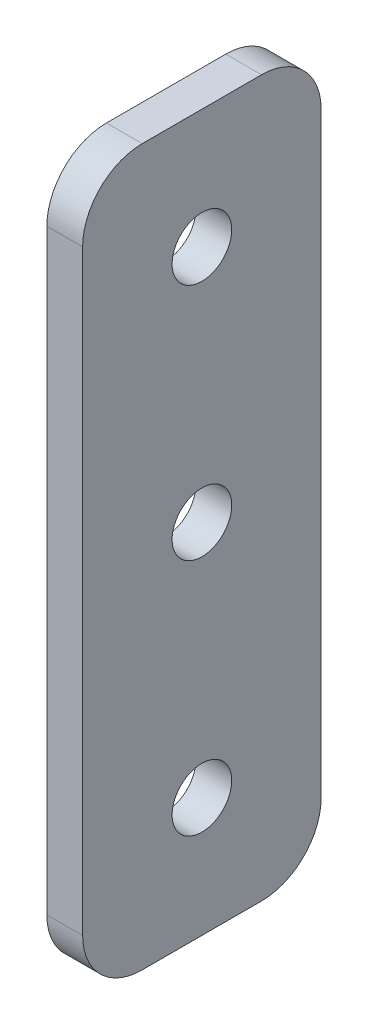
ISO-10303-21;
HEADER;
FILE_DESCRIPTION(('STEP AP214'),'2;1');
FILE_NAME('part.step','',(''),(''),'','','');
FILE_SCHEMA(('AUTOMOTIVE_DESIGN { 1 0 10303 214 1 1 1 1 }'));
ENDSEC;
DATA;
#1=APPLICATION_CONTEXT('core data for automotive mechanical design processes');
#2=APPLICATION_PROTOCOL_DEFINITION('international standard','automotive_design',2000,#1);
#3=PRODUCT_CONTEXT('',#1,'mechanical');
#4=PRODUCT('Part','Part','',(#3));
#5=PRODUCT_RELATED_PRODUCT_CATEGORY('part','',(#4));
#6=PRODUCT_DEFINITION_FORMATION('','',#4);
#7=PRODUCT_DEFINITION_CONTEXT('part definition',#1,'design');
#8=PRODUCT_DEFINITION('design','',#6,#7);
#9=PRODUCT_DEFINITION_SHAPE('','',#8);
#10=(LENGTH_UNIT() NAMED_UNIT(*) SI_UNIT(.MILLI.,.METRE.));
#11=(NAMED_UNIT(*) PLANE_ANGLE_UNIT() SI_UNIT($,.RADIAN.));
#12=(NAMED_UNIT(*) SI_UNIT($,.STERADIAN.) SOLID_ANGLE_UNIT());
#13=UNCERTAINTY_MEASURE_WITH_UNIT(LENGTH_MEASURE(1.E-05),#10,'distance_accuracy_value','');
#14=(GEOMETRIC_REPRESENTATION_CONTEXT(3) GLOBAL_UNCERTAINTY_ASSIGNED_CONTEXT((#13)) GLOBAL_UNIT_ASSIGNED_CONTEXT((#10,
#11,#12)) REPRESENTATION_CONTEXT('',''));
#15=CARTESIAN_POINT('',(0.,0.,0.));
#16=DIRECTION('',(0.,0.,1.));
#17=DIRECTION('',(1.,0.,0.));
#18=AXIS2_PLACEMENT_3D('',#15,#16,#17);
#19=CARTESIAN_POINT('',(3.,0.,0.));
#20=DIRECTION('',(1.,0.,0.));
#21=DIRECTION('',(0.,0.,-1.));
#22=AXIS2_PLACEMENT_3D('',#19,#20,#21);
#23=PLANE('',#22);
#24=CARTESIAN_POINT('',(3.,30.,0.));
#25=DIRECTION('',(1.,0.,0.));
#26=DIRECTION('',(0.,0.,-1.));
#27=AXIS2_PLACEMENT_3D('',#24,#25,#26);
#28=CIRCLE('',#27,2.5);
#29=CARTESIAN_POINT('',(3.,30.,-2.5));
#30=VERTEX_POINT('',#29);
#31=EDGE_CURVE('E183',#30,#30,#28,.T.);
#32=ORIENTED_EDGE('',*,*,#31,.F.);
#33=EDGE_LOOP('',(#32));
#34=FACE_BOUND('',#33,.T.);
#35=DIRECTION('',(0.,0.,-1.));
#36=VECTOR('',#35,1.);
#37=CARTESIAN_POINT('',(3.,0.,10.));
#38=LINE('',#37,#36);
#39=CARTESIAN_POINT('',(3.,0.,5.));
#40=VERTEX_POINT('',#39);
#41=CARTESIAN_POINT('',(3.,0.,-5.));
#42=VERTEX_POINT('',#41);
#43=EDGE_CURVE('E168',#40,#42,#38,.T.);
#44=ORIENTED_EDGE('',*,*,#43,.T.);
#45=CARTESIAN_POINT('',(3.,5.,-5.));
#46=DIRECTION('',(1.,0.,0.));
#47=DIRECTION('',(0.,0.,-1.));
#48=AXIS2_PLACEMENT_3D('',#45,#46,#47);
#49=CIRCLE('',#48,5.);
#50=CARTESIAN_POINT('',(3.,5.,-10.));
#51=VERTEX_POINT('',#50);
#52=EDGE_CURVE('E148',#42,#51,#49,.T.);
#53=ORIENTED_EDGE('',*,*,#52,.T.);
#54=DIRECTION('',(0.,1.,0.));
#55=VECTOR('',#54,1.);
#56=CARTESIAN_POINT('',(3.,60.,-9.99999999999999));
#57=LINE('',#56,#55);
#58=CARTESIAN_POINT('',(3.,55.,-9.99999999999999));
#59=VERTEX_POINT('',#58);
#60=EDGE_CURVE('E118',#51,#59,#57,.T.);
#61=ORIENTED_EDGE('',*,*,#60,.T.);
#62=CARTESIAN_POINT('',(3.,55.,-4.99999999999999));
#63=DIRECTION('',(1.,0.,0.));
#64=DIRECTION('',(0.,0.,-1.));
#65=AXIS2_PLACEMENT_3D('',#62,#63,#64);
#66=CIRCLE('',#65,5.);
#67=CARTESIAN_POINT('',(3.,60.,-4.99999999999999));
#68=VERTEX_POINT('',#67);
#69=EDGE_CURVE('E54',#59,#68,#66,.T.);
#70=ORIENTED_EDGE('',*,*,#69,.T.);
#71=DIRECTION('',(0.,0.,1.));
#72=VECTOR('',#71,1.);
#73=CARTESIAN_POINT('',(3.,60.,10.));
#74=LINE('',#73,#72);
#75=CARTESIAN_POINT('',(3.,60.,5.00000000000001));
#76=VERTEX_POINT('',#75);
#77=EDGE_CURVE('E135',#68,#76,#74,.T.);
#78=ORIENTED_EDGE('',*,*,#77,.T.);
#79=CARTESIAN_POINT('',(3.,55.,5.00000000000001));
#80=DIRECTION('',(1.,0.,0.));
#81=DIRECTION('',(0.,0.,-1.));
#82=AXIS2_PLACEMENT_3D('',#79,#80,#81);
#83=CIRCLE('',#82,5.);
#84=CARTESIAN_POINT('',(3.,55.,10.));
#85=VERTEX_POINT('',#84);
#86=EDGE_CURVE('E143',#76,#85,#83,.T.);
#87=ORIENTED_EDGE('',*,*,#86,.T.);
#88=DIRECTION('',(0.,-1.,0.));
#89=VECTOR('',#88,1.);
#90=CARTESIAN_POINT('',(3.,60.,10.));
#91=LINE('',#90,#89);
#92=CARTESIAN_POINT('',(3.,5.,10.));
#93=VERTEX_POINT('',#92);
#94=EDGE_CURVE('E129',#85,#93,#91,.T.);
#95=ORIENTED_EDGE('',*,*,#94,.T.);
#96=CARTESIAN_POINT('',(3.,5.,5.));
#97=DIRECTION('',(1.,0.,0.));
#98=DIRECTION('',(0.,0.,-1.));
#99=AXIS2_PLACEMENT_3D('',#96,#97,#98);
#100=CIRCLE('',#99,5.);
#101=EDGE_CURVE('E146',#93,#40,#100,.T.);
#102=ORIENTED_EDGE('',*,*,#101,.T.);
#103=EDGE_LOOP('',(#44,#53,#61,#70,#78,#87,#95,#102));
#104=FACE_BOUND('',#103,.T.);
#105=CARTESIAN_POINT('',(3.,10.,0.));
#106=DIRECTION('',(1.,0.,0.));
#107=DIRECTION('',(0.,0.,-1.));
#108=AXIS2_PLACEMENT_3D('',#105,#106,#107);
#109=CIRCLE('',#108,2.5);
#110=CARTESIAN_POINT('',(3.,10.,-2.5));
#111=VERTEX_POINT('',#110);
#112=EDGE_CURVE('E174',#111,#111,#109,.T.);
#113=ORIENTED_EDGE('',*,*,#112,.F.);
#114=EDGE_LOOP('',(#113));
#115=FACE_BOUND('',#114,.T.);
#116=CARTESIAN_POINT('',(3.,50.,0.));
#117=DIRECTION('',(1.,0.,0.));
#118=DIRECTION('',(0.,0.,-1.));
#119=AXIS2_PLACEMENT_3D('',#116,#117,#118);
#120=CIRCLE('',#119,2.5);
#121=CARTESIAN_POINT('',(3.,50.,-2.5));
#122=VERTEX_POINT('',#121);
#123=EDGE_CURVE('E188',#122,#122,#120,.T.);
#124=ORIENTED_EDGE('',*,*,#123,.F.);
#125=EDGE_LOOP('',(#124));
#126=FACE_BOUND('',#125,.T.);
#127=ADVANCED_FACE('F33',(#34,#104,#115,#126),#23,.T.);
#128=CARTESIAN_POINT('',(0.,0.,0.));
#129=DIRECTION('',(1.,0.,0.));
#130=DIRECTION('',(0.,0.,-1.));
#131=AXIS2_PLACEMENT_3D('',#128,#129,#130);
#132=PLANE('',#131);
#133=CARTESIAN_POINT('',(0.,30.,0.));
#134=DIRECTION('',(1.,0.,0.));
#135=DIRECTION('',(0.,0.,-1.));
#136=AXIS2_PLACEMENT_3D('',#133,#134,#135);
#137=CIRCLE('',#136,2.5);
#138=CARTESIAN_POINT('',(0.,30.,-2.5));
#139=VERTEX_POINT('',#138);
#140=EDGE_CURVE('E185',#139,#139,#137,.T.);
#141=ORIENTED_EDGE('',*,*,#140,.T.);
#142=EDGE_LOOP('',(#141));
#143=FACE_BOUND('',#142,.T.);
#144=DIRECTION('',(0.,1.,0.));
#145=VECTOR('',#144,1.);
#146=CARTESIAN_POINT('',(0.,60.,-9.99999999999999));
#147=LINE('',#146,#145);
#148=CARTESIAN_POINT('',(0.,5.,-10.));
#149=VERTEX_POINT('',#148);
#150=CARTESIAN_POINT('',(0.,55.,-9.99999999999999));
#151=VERTEX_POINT('',#150);
#152=EDGE_CURVE('E116',#149,#151,#147,.T.);
#153=ORIENTED_EDGE('',*,*,#152,.F.);
#154=CARTESIAN_POINT('',(0.,5.,-5.));
#155=DIRECTION('',(1.,0.,0.));
#156=DIRECTION('',(0.,0.,-1.));
#157=AXIS2_PLACEMENT_3D('',#154,#155,#156);
#158=CIRCLE('',#157,5.);
#159=CARTESIAN_POINT('',(0.,0.,-5.));
#160=VERTEX_POINT('',#159);
#161=EDGE_CURVE('E99',#149,#160,#158,.F.);
#162=ORIENTED_EDGE('',*,*,#161,.T.);
#163=DIRECTION('',(0.,0.,-1.));
#164=VECTOR('',#163,1.);
#165=CARTESIAN_POINT('',(0.,0.,10.));
#166=LINE('',#165,#164);
#167=CARTESIAN_POINT('',(0.,0.,5.));
#168=VERTEX_POINT('',#167);
#169=EDGE_CURVE('E127',#168,#160,#166,.T.);
#170=ORIENTED_EDGE('',*,*,#169,.F.);
#171=CARTESIAN_POINT('',(0.,5.,5.));
#172=DIRECTION('',(1.,0.,0.));
#173=DIRECTION('',(0.,0.,-1.));
#174=AXIS2_PLACEMENT_3D('',#171,#172,#173);
#175=CIRCLE('',#174,5.);
#176=CARTESIAN_POINT('',(0.,5.,10.));
#177=VERTEX_POINT('',#176);
#178=EDGE_CURVE('E110',#168,#177,#175,.F.);
#179=ORIENTED_EDGE('',*,*,#178,.T.);
#180=DIRECTION('',(0.,-1.,0.));
#181=VECTOR('',#180,1.);
#182=CARTESIAN_POINT('',(0.,60.,10.));
#183=LINE('',#182,#181);
#184=CARTESIAN_POINT('',(0.,55.,10.));
#185=VERTEX_POINT('',#184);
#186=EDGE_CURVE('E131',#185,#177,#183,.T.);
#187=ORIENTED_EDGE('',*,*,#186,.F.);
#188=CARTESIAN_POINT('',(0.,55.,5.00000000000001));
#189=DIRECTION('',(1.,0.,0.));
#190=DIRECTION('',(0.,0.,-1.));
#191=AXIS2_PLACEMENT_3D('',#188,#189,#190);
#192=CIRCLE('',#191,5.);
#193=CARTESIAN_POINT('',(0.,60.,5.00000000000001));
#194=VERTEX_POINT('',#193);
#195=EDGE_CURVE('E119',#185,#194,#192,.F.);
#196=ORIENTED_EDGE('',*,*,#195,.T.);
#197=DIRECTION('',(0.,0.,1.));
#198=VECTOR('',#197,1.);
#199=CARTESIAN_POINT('',(0.,60.,10.));
#200=LINE('',#199,#198);
#201=CARTESIAN_POINT('',(0.,60.,-4.99999999999999));
#202=VERTEX_POINT('',#201);
#203=EDGE_CURVE('E126',#202,#194,#200,.T.);
#204=ORIENTED_EDGE('',*,*,#203,.F.);
#205=CARTESIAN_POINT('',(0.,55.,-4.99999999999999));
#206=DIRECTION('',(1.,0.,0.));
#207=DIRECTION('',(0.,0.,-1.));
#208=AXIS2_PLACEMENT_3D('',#205,#206,#207);
#209=CIRCLE('',#208,5.);
#210=EDGE_CURVE('E125',#202,#151,#209,.F.);
#211=ORIENTED_EDGE('',*,*,#210,.T.);
#212=EDGE_LOOP('',(#153,#162,#170,#179,#187,#196,#204,#211));
#213=FACE_BOUND('',#212,.T.);
#214=CARTESIAN_POINT('',(0.,10.,0.));
#215=DIRECTION('',(1.,0.,0.));
#216=DIRECTION('',(0.,0.,-1.));
#217=AXIS2_PLACEMENT_3D('',#214,#215,#216);
#218=CIRCLE('',#217,2.5);
#219=CARTESIAN_POINT('',(0.,10.,-2.5));
#220=VERTEX_POINT('',#219);
#221=EDGE_CURVE('E176',#220,#220,#218,.T.);
#222=ORIENTED_EDGE('',*,*,#221,.T.);
#223=EDGE_LOOP('',(#222));
#224=FACE_BOUND('',#223,.T.);
#225=CARTESIAN_POINT('',(0.,50.,0.));
#226=DIRECTION('',(1.,0.,0.));
#227=DIRECTION('',(0.,0.,-1.));
#228=AXIS2_PLACEMENT_3D('',#225,#226,#227);
#229=CIRCLE('',#228,2.5);
#230=CARTESIAN_POINT('',(0.,50.,-2.5));
#231=VERTEX_POINT('',#230);
#232=EDGE_CURVE('E191',#231,#231,#229,.T.);
#233=ORIENTED_EDGE('',*,*,#232,.T.);
#234=EDGE_LOOP('',(#233));
#235=FACE_BOUND('',#234,.T.);
#236=ADVANCED_FACE('F122',(#143,#213,#224,#235),#132,.F.);
#237=CARTESIAN_POINT('',(3.,60.,10.));
#238=DIRECTION('',(0.,0.,-1.));
#239=DIRECTION('',(0.,1.,0.));
#240=AXIS2_PLACEMENT_3D('',#237,#238,#239);
#241=PLANE('',#240);
#242=ORIENTED_EDGE('',*,*,#186,.T.);
#243=DIRECTION('',(-1.,0.,0.));
#244=VECTOR('',#243,1.);
#245=CARTESIAN_POINT('',(3.,5.,10.));
#246=LINE('',#245,#244);
#247=EDGE_CURVE('E153',#177,#93,#246,.F.);
#248=ORIENTED_EDGE('',*,*,#247,.T.);
#249=ORIENTED_EDGE('',*,*,#94,.F.);
#250=DIRECTION('',(-1.,0.,0.));
#251=VECTOR('',#250,1.);
#252=CARTESIAN_POINT('',(3.,55.,10.));
#253=LINE('',#252,#251);
#254=EDGE_CURVE('E150',#85,#185,#253,.T.);
#255=ORIENTED_EDGE('',*,*,#254,.T.);
#256=EDGE_LOOP('',(#242,#248,#249,#255));
#257=FACE_BOUND('',#256,.T.);
#258=ADVANCED_FACE('F159',(#257),#241,.F.);
#259=CARTESIAN_POINT('',(3.,0.,10.));
#260=DIRECTION('',(0.,1.,0.));
#261=DIRECTION('',(0.,0.,1.));
#262=AXIS2_PLACEMENT_3D('',#259,#260,#261);
#263=PLANE('',#262);
#264=ORIENTED_EDGE('',*,*,#169,.T.);
#265=DIRECTION('',(-1.,0.,0.));
#266=VECTOR('',#265,1.);
#267=CARTESIAN_POINT('',(3.,0.,-5.));
#268=LINE('',#267,#266);
#269=EDGE_CURVE('E104',#160,#42,#268,.F.);
#270=ORIENTED_EDGE('',*,*,#269,.T.);
#271=ORIENTED_EDGE('',*,*,#43,.F.);
#272=DIRECTION('',(-1.,0.,0.));
#273=VECTOR('',#272,1.);
#274=CARTESIAN_POINT('',(3.,0.,5.));
#275=LINE('',#274,#273);
#276=EDGE_CURVE('E109',#40,#168,#275,.T.);
#277=ORIENTED_EDGE('',*,*,#276,.T.);
#278=EDGE_LOOP('',(#264,#270,#271,#277));
#279=FACE_BOUND('',#278,.T.);
#280=ADVANCED_FACE('F173',(#279),#263,.F.);
#281=CARTESIAN_POINT('',(3.,60.,-9.99999999999999));
#282=DIRECTION('',(0.,0.,1.));
#283=DIRECTION('',(0.,-1.,0.));
#284=AXIS2_PLACEMENT_3D('',#281,#282,#283);
#285=PLANE('',#284);
#286=ORIENTED_EDGE('',*,*,#60,.F.);
#287=DIRECTION('',(-1.,0.,0.));
#288=VECTOR('',#287,1.);
#289=CARTESIAN_POINT('',(3.,5.,-10.));
#290=LINE('',#289,#288);
#291=EDGE_CURVE('E103',#51,#149,#290,.T.);
#292=ORIENTED_EDGE('',*,*,#291,.T.);
#293=ORIENTED_EDGE('',*,*,#152,.T.);
#294=DIRECTION('',(-1.,0.,0.));
#295=VECTOR('',#294,1.);
#296=CARTESIAN_POINT('',(3.,55.,-9.99999999999999));
#297=LINE('',#296,#295);
#298=EDGE_CURVE('E120',#151,#59,#297,.F.);
#299=ORIENTED_EDGE('',*,*,#298,.T.);
#300=EDGE_LOOP('',(#286,#292,#293,#299));
#301=FACE_BOUND('',#300,.T.);
#302=ADVANCED_FACE('F115',(#301),#285,.F.);
#303=CARTESIAN_POINT('',(3.,60.,10.));
#304=DIRECTION('',(0.,-1.,0.));
#305=DIRECTION('',(0.,0.,-1.));
#306=AXIS2_PLACEMENT_3D('',#303,#304,#305);
#307=PLANE('',#306);
#308=ORIENTED_EDGE('',*,*,#77,.F.);
#309=DIRECTION('',(-1.,0.,0.));
#310=VECTOR('',#309,1.);
#311=CARTESIAN_POINT('',(3.,60.,-4.99999999999999));
#312=LINE('',#311,#310);
#313=EDGE_CURVE('E11',#68,#202,#312,.T.);
#314=ORIENTED_EDGE('',*,*,#313,.T.);
#315=ORIENTED_EDGE('',*,*,#203,.T.);
#316=DIRECTION('',(-1.,0.,0.));
#317=VECTOR('',#316,1.);
#318=CARTESIAN_POINT('',(3.,60.,5.00000000000001));
#319=LINE('',#318,#317);
#320=EDGE_CURVE('E41',#194,#76,#319,.F.);
#321=ORIENTED_EDGE('',*,*,#320,.T.);
#322=EDGE_LOOP('',(#308,#314,#315,#321));
#323=FACE_BOUND('',#322,.T.);
#324=ADVANCED_FACE('F213',(#323),#307,.F.);
#325=CARTESIAN_POINT('',(3.,10.,0.));
#326=DIRECTION('',(-1.,0.,0.));
#327=DIRECTION('',(0.,0.,1.));
#328=AXIS2_PLACEMENT_3D('',#325,#326,#327);
#329=CYLINDRICAL_SURFACE('',#328,2.5);
#330=ORIENTED_EDGE('',*,*,#112,.T.);
#331=EDGE_LOOP('',(#330));
#332=FACE_BOUND('',#331,.T.);
#333=ORIENTED_EDGE('',*,*,#221,.F.);
#334=EDGE_LOOP('',(#333));
#335=FACE_BOUND('',#334,.T.);
#336=ADVANCED_FACE('F210',(#332,#335),#329,.F.);
#337=CARTESIAN_POINT('',(3.,30.,0.));
#338=DIRECTION('',(-1.,0.,0.));
#339=DIRECTION('',(0.,0.,1.));
#340=AXIS2_PLACEMENT_3D('',#337,#338,#339);
#341=CYLINDRICAL_SURFACE('',#340,2.5);
#342=ORIENTED_EDGE('',*,*,#31,.T.);
#343=EDGE_LOOP('',(#342));
#344=FACE_BOUND('',#343,.T.);
#345=ORIENTED_EDGE('',*,*,#140,.F.);
#346=EDGE_LOOP('',(#345));
#347=FACE_BOUND('',#346,.T.);
#348=ADVANCED_FACE('F296',(#344,#347),#341,.F.);
#349=CARTESIAN_POINT('',(3.,50.,0.));
#350=DIRECTION('',(-1.,0.,0.));
#351=DIRECTION('',(0.,0.,1.));
#352=AXIS2_PLACEMENT_3D('',#349,#350,#351);
#353=CYLINDRICAL_SURFACE('',#352,2.5);
#354=ORIENTED_EDGE('',*,*,#123,.T.);
#355=EDGE_LOOP('',(#354));
#356=FACE_BOUND('',#355,.T.);
#357=ORIENTED_EDGE('',*,*,#232,.F.);
#358=EDGE_LOOP('',(#357));
#359=FACE_BOUND('',#358,.T.);
#360=ADVANCED_FACE('F197',(#356,#359),#353,.F.);
#361=CARTESIAN_POINT('',(3.,5.,-5.));
#362=DIRECTION('',(-1.,0.,0.));
#363=DIRECTION('',(0.,0.,1.));
#364=AXIS2_PLACEMENT_3D('',#361,#362,#363);
#365=CYLINDRICAL_SURFACE('',#364,5.);
#366=ORIENTED_EDGE('',*,*,#52,.F.);
#367=ORIENTED_EDGE('',*,*,#269,.F.);
#368=ORIENTED_EDGE('',*,*,#161,.F.);
#369=ORIENTED_EDGE('',*,*,#291,.F.);
#370=EDGE_LOOP('',(#366,#367,#368,#369));
#371=FACE_BOUND('',#370,.T.);
#372=ADVANCED_FACE('F102',(#371),#365,.T.);
#373=CARTESIAN_POINT('',(3.,5.,5.));
#374=DIRECTION('',(-1.,0.,0.));
#375=DIRECTION('',(0.,0.,1.));
#376=AXIS2_PLACEMENT_3D('',#373,#374,#375);
#377=CYLINDRICAL_SURFACE('',#376,5.);
#378=ORIENTED_EDGE('',*,*,#101,.F.);
#379=ORIENTED_EDGE('',*,*,#247,.F.);
#380=ORIENTED_EDGE('',*,*,#178,.F.);
#381=ORIENTED_EDGE('',*,*,#276,.F.);
#382=EDGE_LOOP('',(#378,#379,#380,#381));
#383=FACE_BOUND('',#382,.T.);
#384=ADVANCED_FACE('F171',(#383),#377,.T.);
#385=CARTESIAN_POINT('',(3.,55.,-4.99999999999999));
#386=DIRECTION('',(-1.,0.,0.));
#387=DIRECTION('',(0.,0.,1.));
#388=AXIS2_PLACEMENT_3D('',#385,#386,#387);
#389=CYLINDRICAL_SURFACE('',#388,5.);
#390=ORIENTED_EDGE('',*,*,#69,.F.);
#391=ORIENTED_EDGE('',*,*,#298,.F.);
#392=ORIENTED_EDGE('',*,*,#210,.F.);
#393=ORIENTED_EDGE('',*,*,#313,.F.);
#394=EDGE_LOOP('',(#390,#391,#392,#393));
#395=FACE_BOUND('',#394,.T.);
#396=ADVANCED_FACE('F225',(#395),#389,.T.);
#397=CARTESIAN_POINT('',(3.,55.,5.00000000000001));
#398=DIRECTION('',(-1.,0.,0.));
#399=DIRECTION('',(0.,0.,1.));
#400=AXIS2_PLACEMENT_3D('',#397,#398,#399);
#401=CYLINDRICAL_SURFACE('',#400,5.);
#402=ORIENTED_EDGE('',*,*,#86,.F.);
#403=ORIENTED_EDGE('',*,*,#320,.F.);
#404=ORIENTED_EDGE('',*,*,#195,.F.);
#405=ORIENTED_EDGE('',*,*,#254,.F.);
#406=EDGE_LOOP('',(#402,#403,#404,#405));
#407=FACE_BOUND('',#406,.T.);
#408=ADVANCED_FACE('F35',(#407),#401,.T.);
#409=CLOSED_SHELL('',(#127,#236,#258,#280,#302,#324,#336,#348,#360,#372,#384,#396,#408));
#410=MANIFOLD_SOLID_BREP('B2',#409);
#411=ADVANCED_BREP_SHAPE_REPRESENTATION('',(#18,#410),#14);
#412=SHAPE_DEFINITION_REPRESENTATION(#9,#411);
ENDSEC;
END-ISO-10303-21;
